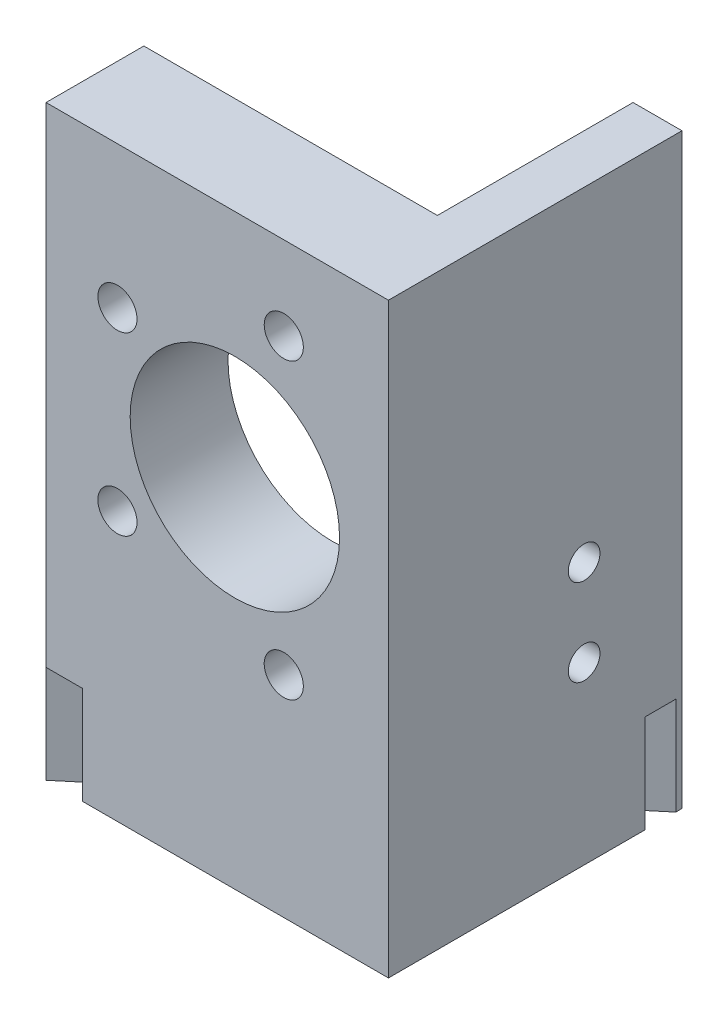
ISO-10303-21;
HEADER;
FILE_DESCRIPTION(('STEP AP214'),'2;1');
FILE_NAME('part.step','',(''),(''),'','','');
FILE_SCHEMA(('AUTOMOTIVE_DESIGN { 1 0 10303 214 1 1 1 1 }'));
ENDSEC;
DATA;
#1=APPLICATION_CONTEXT('core data for automotive mechanical design processes');
#2=APPLICATION_PROTOCOL_DEFINITION('international standard','automotive_design',2000,#1);
#3=PRODUCT_CONTEXT('',#1,'mechanical');
#4=PRODUCT('Part','Part','',(#3));
#5=PRODUCT_RELATED_PRODUCT_CATEGORY('part','',(#4));
#6=PRODUCT_DEFINITION_FORMATION('','',#4);
#7=PRODUCT_DEFINITION_CONTEXT('part definition',#1,'design');
#8=PRODUCT_DEFINITION('design','',#6,#7);
#9=PRODUCT_DEFINITION_SHAPE('','',#8);
#10=(LENGTH_UNIT() NAMED_UNIT(*) SI_UNIT(.MILLI.,.METRE.));
#11=(NAMED_UNIT(*) PLANE_ANGLE_UNIT() SI_UNIT($,.RADIAN.));
#12=(NAMED_UNIT(*) SI_UNIT($,.STERADIAN.) SOLID_ANGLE_UNIT());
#13=UNCERTAINTY_MEASURE_WITH_UNIT(LENGTH_MEASURE(1.E-05),#10,'distance_accuracy_value','');
#14=(GEOMETRIC_REPRESENTATION_CONTEXT(3) GLOBAL_UNCERTAINTY_ASSIGNED_CONTEXT((#13)) GLOBAL_UNIT_ASSIGNED_CONTEXT((#10,
#11,#12)) REPRESENTATION_CONTEXT('',''));
#15=CARTESIAN_POINT('',(0.,0.,0.));
#16=DIRECTION('',(0.,0.,1.));
#17=DIRECTION('',(1.,0.,0.));
#18=AXIS2_PLACEMENT_3D('',#15,#16,#17);
#19=CARTESIAN_POINT('',(0.,0.,0.));
#20=DIRECTION('',(0.,1.,0.));
#21=DIRECTION('',(0.,0.,1.));
#22=AXIS2_PLACEMENT_3D('',#19,#20,#21);
#23=PLANE('',#22);
#24=DIRECTION('',(1.,0.,0.));
#25=VECTOR('',#24,1.);
#26=CARTESIAN_POINT('',(-44.45,0.,0.));
#27=LINE('',#26,#25);
#28=CARTESIAN_POINT('',(-39.7081537757294,0.,0.));
#29=VERTEX_POINT('',#28);
#30=CARTESIAN_POINT('',(0.,0.,0.));
#31=VERTEX_POINT('',#30);
#32=EDGE_CURVE('E174',#29,#31,#27,.T.);
#33=ORIENTED_EDGE('',*,*,#32,.F.);
#34=DIRECTION('',(0.766044443118982,0.,-0.642787609686534));
#35=VECTOR('',#34,1.);
#36=CARTESIAN_POINT('',(-16.4064526170276,0.,-19.5524488480696));
#37=LINE('',#36,#35);
#38=CARTESIAN_POINT('',(-24.5728831497828,0.,-12.7));
#39=VERTEX_POINT('',#38);
#40=EDGE_CURVE('E43',#29,#39,#37,.T.);
#41=ORIENTED_EDGE('',*,*,#40,.T.);
#42=DIRECTION('',(-1.,0.,0.));
#43=VECTOR('',#42,1.);
#44=CARTESIAN_POINT('',(-6.35000000000001,0.,-12.7));
#45=LINE('',#44,#43);
#46=CARTESIAN_POINT('',(-6.35000000000001,0.,-12.7));
#47=VERTEX_POINT('',#46);
#48=EDGE_CURVE('E163',#47,#39,#45,.T.);
#49=ORIENTED_EDGE('',*,*,#48,.F.);
#50=DIRECTION('',(0.,0.,1.));
#51=VECTOR('',#50,1.);
#52=CARTESIAN_POINT('',(-6.35,0.,-38.1));
#53=LINE('',#52,#51);
#54=CARTESIAN_POINT('',(-6.35,0.,-27.9908145299692));
#55=VERTEX_POINT('',#54);
#56=EDGE_CURVE('E182',#55,#47,#53,.T.);
#57=ORIENTED_EDGE('',*,*,#56,.F.);
#58=CARTESIAN_POINT('',(0.,0.,-33.3190971879449));
#59=VERTEX_POINT('',#58);
#60=EDGE_CURVE('E203',#55,#59,#37,.T.);
#61=ORIENTED_EDGE('',*,*,#60,.T.);
#62=DIRECTION('',(0.,0.,-1.));
#63=VECTOR('',#62,1.);
#64=CARTESIAN_POINT('',(0.,0.,0.));
#65=LINE('',#64,#63);
#66=EDGE_CURVE('E177',#31,#59,#65,.T.);
#67=ORIENTED_EDGE('',*,*,#66,.F.);
#68=EDGE_LOOP('',(#33,#41,#49,#57,#61,#67));
#69=FACE_BOUND('',#68,.T.);
#70=ADVANCED_FACE('F35',(#69),#23,.F.);
#71=CARTESIAN_POINT('',(0.,0.,-37.2979786058297));
#72=VERTEX_POINT('',#71);
#73=CARTESIAN_POINT('',(0.,0.,-38.1));
#74=VERTEX_POINT('',#73);
#75=EDGE_CURVE('E176',#72,#74,#65,.T.);
#76=ORIENTED_EDGE('',*,*,#75,.F.);
#77=DIRECTION('',(-0.766044443118982,0.,0.642787609686535));
#78=VECTOR('',#77,1.);
#79=CARTESIAN_POINT('',(-18.3656692513522,0.,-21.8873523106963));
#80=LINE('',#79,#78);
#81=CARTESIAN_POINT('',(-6.35,0.,-31.969695947854));
#82=VERTEX_POINT('',#81);
#83=EDGE_CURVE('E147',#72,#82,#80,.T.);
#84=ORIENTED_EDGE('',*,*,#83,.T.);
#85=CARTESIAN_POINT('',(-6.35,0.,-38.1));
#86=VERTEX_POINT('',#85);
#87=EDGE_CURVE('E183',#86,#82,#53,.T.);
#88=ORIENTED_EDGE('',*,*,#87,.F.);
#89=DIRECTION('',(-1.,0.,0.));
#90=VECTOR('',#89,1.);
#91=CARTESIAN_POINT('',(0.,0.,-38.1));
#92=LINE('',#91,#90);
#93=EDGE_CURVE('E180',#74,#86,#92,.T.);
#94=ORIENTED_EDGE('',*,*,#93,.F.);
#95=EDGE_LOOP('',(#76,#84,#88,#94));
#96=FACE_BOUND('',#95,.T.);
#97=ADVANCED_FACE('F212',(#96),#23,.F.);
#98=CARTESIAN_POINT('',(-6.35000000000001,76.2,-12.7));
#99=DIRECTION('',(0.,0.,1.));
#100=DIRECTION('',(1.,0.,0.));
#101=AXIS2_PLACEMENT_3D('',#98,#99,#100);
#102=PLANE('',#101);
#103=ORIENTED_EDGE('',*,*,#48,.T.);
#104=DIRECTION('',(0.,1.,0.));
#105=VECTOR('',#104,1.);
#106=CARTESIAN_POINT('',(-24.5728831497828,76.2,-12.7));
#107=LINE('',#106,#105);
#108=CARTESIAN_POINT('',(-24.5728831497828,12.7,-12.7));
#109=VERTEX_POINT('',#108);
#110=EDGE_CURVE('E248',#39,#109,#107,.T.);
#111=ORIENTED_EDGE('',*,*,#110,.T.);
#112=DIRECTION('',(-1.,0.,0.));
#113=VECTOR('',#112,1.);
#114=CARTESIAN_POINT('',(-6.35000000000001,12.7,-12.7));
#115=LINE('',#114,#113);
#116=CARTESIAN_POINT('',(-29.3147293740534,12.7,-12.7));
#117=VERTEX_POINT('',#116);
#118=EDGE_CURVE('E157',#109,#117,#115,.T.);
#119=ORIENTED_EDGE('',*,*,#118,.T.);
#120=DIRECTION('',(0.,-1.,0.));
#121=VECTOR('',#120,1.);
#122=CARTESIAN_POINT('',(-29.3147293740534,76.2,-12.7));
#123=LINE('',#122,#121);
#124=CARTESIAN_POINT('',(-29.3147293740534,0.,-12.7));
#125=VERTEX_POINT('',#124);
#126=EDGE_CURVE('E139',#117,#125,#123,.T.);
#127=ORIENTED_EDGE('',*,*,#126,.T.);
#128=CARTESIAN_POINT('',(-44.45,0.,-12.7));
#129=VERTEX_POINT('',#128);
#130=EDGE_CURVE('E155',#125,#129,#45,.T.);
#131=ORIENTED_EDGE('',*,*,#130,.T.);
#132=DIRECTION('',(0.,-1.,0.));
#133=VECTOR('',#132,1.);
#134=CARTESIAN_POINT('',(-44.45,76.2,-12.7));
#135=LINE('',#134,#133);
#136=CARTESIAN_POINT('',(-44.45,76.2,-12.7));
#137=VERTEX_POINT('',#136);
#138=EDGE_CURVE('E148',#137,#129,#135,.T.);
#139=ORIENTED_EDGE('',*,*,#138,.F.);
#140=DIRECTION('',(-1.,0.,0.));
#141=VECTOR('',#140,1.);
#142=CARTESIAN_POINT('',(-6.35000000000001,76.2,-12.7));
#143=LINE('',#142,#141);
#144=CARTESIAN_POINT('',(-6.35000000000001,76.2,-12.7));
#145=VERTEX_POINT('',#144);
#146=EDGE_CURVE('E186',#145,#137,#143,.T.);
#147=ORIENTED_EDGE('',*,*,#146,.F.);
#148=DIRECTION('',(0.,-1.,0.));
#149=VECTOR('',#148,1.);
#150=CARTESIAN_POINT('',(-6.35000000000001,76.2,-12.7));
#151=LINE('',#150,#149);
#152=CARTESIAN_POINT('',(-6.35000000000001,46.3296,-12.7));
#153=VERTEX_POINT('',#152);
#154=EDGE_CURVE('E187',#145,#153,#151,.T.);
#155=ORIENTED_EDGE('',*,*,#154,.T.);
#156=CARTESIAN_POINT('',(-19.939,46.3296,-12.7));
#157=DIRECTION('',(0.,0.,-1.));
#158=DIRECTION('',(-1.,0.,0.));
#159=AXIS2_PLACEMENT_3D('',#156,#157,#158);
#160=CIRCLE('',#159,13.589);
#161=EDGE_CURVE('E56',#153,#153,#160,.T.);
#162=ORIENTED_EDGE('',*,*,#161,.F.);
#163=EDGE_CURVE('E191',#153,#47,#151,.T.);
#164=ORIENTED_EDGE('',*,*,#163,.T.);
#165=EDGE_LOOP('',(#103,#111,#119,#127,#131,#139,#147,#155,#162,#164));
#166=FACE_BOUND('',#165,.T.);
#167=CARTESIAN_POINT('',(-35.179,34.8996,-12.7));
#168=DIRECTION('',(0.,0.,-1.));
#169=DIRECTION('',(1.,0.,0.));
#170=AXIS2_PLACEMENT_3D('',#167,#168,#169);
#171=CIRCLE('',#170,2.54);
#172=CARTESIAN_POINT('',(-32.639,34.8996,-12.7));
#173=VERTEX_POINT('',#172);
#174=EDGE_CURVE('E255',#173,#173,#171,.T.);
#175=ORIENTED_EDGE('',*,*,#174,.F.);
#176=EDGE_LOOP('',(#175));
#177=FACE_BOUND('',#176,.T.);
#178=CARTESIAN_POINT('',(-13.589,27.2796,-12.7));
#179=DIRECTION('',(0.,0.,-1.));
#180=DIRECTION('',(1.,0.,0.));
#181=AXIS2_PLACEMENT_3D('',#178,#179,#180);
#182=CIRCLE('',#181,2.53999999999999);
#183=CARTESIAN_POINT('',(-11.049,27.2796,-12.7));
#184=VERTEX_POINT('',#183);
#185=EDGE_CURVE('E259',#184,#184,#182,.T.);
#186=ORIENTED_EDGE('',*,*,#185,.F.);
#187=EDGE_LOOP('',(#186));
#188=FACE_BOUND('',#187,.T.);
#189=CARTESIAN_POINT('',(-13.589,65.3796,-12.7));
#190=DIRECTION('',(0.,0.,-1.));
#191=DIRECTION('',(-1.,0.,0.));
#192=AXIS2_PLACEMENT_3D('',#189,#190,#191);
#193=CIRCLE('',#192,2.54);
#194=CARTESIAN_POINT('',(-16.129,65.3796,-12.7));
#195=VERTEX_POINT('',#194);
#196=EDGE_CURVE('E265',#195,#195,#193,.T.);
#197=ORIENTED_EDGE('',*,*,#196,.F.);
#198=EDGE_LOOP('',(#197));
#199=FACE_BOUND('',#198,.T.);
#200=CARTESIAN_POINT('',(-35.179,57.7596,-12.7));
#201=DIRECTION('',(0.,0.,-1.));
#202=DIRECTION('',(-1.,0.,0.));
#203=AXIS2_PLACEMENT_3D('',#200,#201,#202);
#204=CIRCLE('',#203,2.54);
#205=CARTESIAN_POINT('',(-37.719,57.7596,-12.7));
#206=VERTEX_POINT('',#205);
#207=EDGE_CURVE('E271',#206,#206,#204,.T.);
#208=ORIENTED_EDGE('',*,*,#207,.F.);
#209=EDGE_LOOP('',(#208));
#210=FACE_BOUND('',#209,.T.);
#211=ADVANCED_FACE('F37',(#166,#177,#188,#199,#210),#102,.F.);
#212=CARTESIAN_POINT('',(-44.45,76.2,-12.7));
#213=DIRECTION('',(1.,0.,0.));
#214=DIRECTION('',(0.,0.,-1.));
#215=AXIS2_PLACEMENT_3D('',#212,#213,#214);
#216=PLANE('',#215);
#217=DIRECTION('',(0.,0.,1.));
#218=VECTOR('',#217,1.);
#219=CARTESIAN_POINT('',(-44.45,0.,-12.7));
#220=LINE('',#219,#218);
#221=CARTESIAN_POINT('',(-44.45,0.,0.));
#222=VERTEX_POINT('',#221);
#223=EDGE_CURVE('E161',#129,#222,#220,.T.);
#224=ORIENTED_EDGE('',*,*,#223,.T.);
#225=DIRECTION('',(0.,1.,0.));
#226=VECTOR('',#225,1.);
#227=CARTESIAN_POINT('',(-44.45,76.2,0.));
#228=LINE('',#227,#226);
#229=CARTESIAN_POINT('',(-44.45,12.7,0.));
#230=VERTEX_POINT('',#229);
#231=EDGE_CURVE('E142',#222,#230,#228,.T.);
#232=ORIENTED_EDGE('',*,*,#231,.T.);
#233=DIRECTION('',(0.,-1.,0.));
#234=VECTOR('',#233,1.);
#235=CARTESIAN_POINT('',(-44.45,76.2,0.));
#236=LINE('',#235,#234);
#237=CARTESIAN_POINT('',(-44.45,76.2,0.));
#238=VERTEX_POINT('',#237);
#239=EDGE_CURVE('E200',#238,#230,#236,.T.);
#240=ORIENTED_EDGE('',*,*,#239,.F.);
#241=DIRECTION('',(0.,0.,1.));
#242=VECTOR('',#241,1.);
#243=CARTESIAN_POINT('',(-44.45,76.2,-12.7));
#244=LINE('',#243,#242);
#245=EDGE_CURVE('E293',#137,#238,#244,.T.);
#246=ORIENTED_EDGE('',*,*,#245,.F.);
#247=ORIENTED_EDGE('',*,*,#138,.T.);
#248=EDGE_LOOP('',(#224,#232,#240,#246,#247));
#249=FACE_BOUND('',#248,.T.);
#250=ADVANCED_FACE('F318',(#249),#216,.F.);
#251=CARTESIAN_POINT('',(-44.45,76.2,0.));
#252=DIRECTION('',(0.,0.,-1.));
#253=DIRECTION('',(-1.,0.,0.));
#254=AXIS2_PLACEMENT_3D('',#251,#252,#253);
#255=PLANE('',#254);
#256=CARTESIAN_POINT('',(-35.179,34.8996,0.));
#257=DIRECTION('',(0.,0.,-1.));
#258=DIRECTION('',(1.,0.,0.));
#259=AXIS2_PLACEMENT_3D('',#256,#257,#258);
#260=CIRCLE('',#259,2.54);
#261=CARTESIAN_POINT('',(-32.639,34.8996,0.));
#262=VERTEX_POINT('',#261);
#263=EDGE_CURVE('E256',#262,#262,#260,.T.);
#264=ORIENTED_EDGE('',*,*,#263,.T.);
#265=EDGE_LOOP('',(#264));
#266=FACE_BOUND('',#265,.T.);
#267=CARTESIAN_POINT('',(-13.589,27.2796,0.));
#268=DIRECTION('',(0.,0.,-1.));
#269=DIRECTION('',(1.,0.,0.));
#270=AXIS2_PLACEMENT_3D('',#267,#268,#269);
#271=CIRCLE('',#270,2.53999999999999);
#272=CARTESIAN_POINT('',(-11.049,27.2796,0.));
#273=VERTEX_POINT('',#272);
#274=EDGE_CURVE('E262',#273,#273,#271,.T.);
#275=ORIENTED_EDGE('',*,*,#274,.T.);
#276=EDGE_LOOP('',(#275));
#277=FACE_BOUND('',#276,.T.);
#278=CARTESIAN_POINT('',(-13.589,65.3796,0.));
#279=DIRECTION('',(0.,0.,-1.));
#280=DIRECTION('',(-1.,0.,0.));
#281=AXIS2_PLACEMENT_3D('',#278,#279,#280);
#282=CIRCLE('',#281,2.54);
#283=CARTESIAN_POINT('',(-16.129,65.3796,0.));
#284=VERTEX_POINT('',#283);
#285=EDGE_CURVE('E268',#284,#284,#282,.T.);
#286=ORIENTED_EDGE('',*,*,#285,.T.);
#287=EDGE_LOOP('',(#286));
#288=FACE_BOUND('',#287,.T.);
#289=CARTESIAN_POINT('',(-35.179,57.7596,0.));
#290=DIRECTION('',(0.,0.,-1.));
#291=DIRECTION('',(-1.,0.,0.));
#292=AXIS2_PLACEMENT_3D('',#289,#290,#291);
#293=CIRCLE('',#292,2.54);
#294=CARTESIAN_POINT('',(-37.719,57.7596,0.));
#295=VERTEX_POINT('',#294);
#296=EDGE_CURVE('E274',#295,#295,#293,.T.);
#297=ORIENTED_EDGE('',*,*,#296,.T.);
#298=EDGE_LOOP('',(#297));
#299=FACE_BOUND('',#298,.T.);
#300=CARTESIAN_POINT('',(-19.939,46.3296,0.));
#301=DIRECTION('',(0.,0.,-1.));
#302=DIRECTION('',(-1.,0.,0.));
#303=AXIS2_PLACEMENT_3D('',#300,#301,#302);
#304=CIRCLE('',#303,13.589);
#305=CARTESIAN_POINT('',(-33.528,46.3296,0.));
#306=VERTEX_POINT('',#305);
#307=EDGE_CURVE('E279',#306,#306,#304,.T.);
#308=ORIENTED_EDGE('',*,*,#307,.T.);
#309=EDGE_LOOP('',(#308));
#310=FACE_BOUND('',#309,.T.);
#311=DIRECTION('',(1.,0.,0.));
#312=VECTOR('',#311,1.);
#313=CARTESIAN_POINT('',(-44.45,12.7,0.));
#314=LINE('',#313,#312);
#315=CARTESIAN_POINT('',(-39.7081537757294,12.7,0.));
#316=VERTEX_POINT('',#315);
#317=EDGE_CURVE('E251',#230,#316,#314,.T.);
#318=ORIENTED_EDGE('',*,*,#317,.T.);
#319=DIRECTION('',(0.,-1.,0.));
#320=VECTOR('',#319,1.);
#321=CARTESIAN_POINT('',(-39.7081537757294,76.2,0.));
#322=LINE('',#321,#320);
#323=EDGE_CURVE('E245',#316,#29,#322,.T.);
#324=ORIENTED_EDGE('',*,*,#323,.T.);
#325=ORIENTED_EDGE('',*,*,#32,.T.);
#326=DIRECTION('',(0.,-1.,0.));
#327=VECTOR('',#326,1.);
#328=CARTESIAN_POINT('',(0.,76.2,0.));
#329=LINE('',#328,#327);
#330=CARTESIAN_POINT('',(0.,76.2,0.));
#331=VERTEX_POINT('',#330);
#332=EDGE_CURVE('E197',#331,#31,#329,.T.);
#333=ORIENTED_EDGE('',*,*,#332,.F.);
#334=DIRECTION('',(1.,0.,0.));
#335=VECTOR('',#334,1.);
#336=CARTESIAN_POINT('',(-44.45,76.2,0.));
#337=LINE('',#336,#335);
#338=EDGE_CURVE('E295',#238,#331,#337,.T.);
#339=ORIENTED_EDGE('',*,*,#338,.F.);
#340=ORIENTED_EDGE('',*,*,#239,.T.);
#341=EDGE_LOOP('',(#318,#324,#325,#333,#339,#340));
#342=FACE_BOUND('',#341,.T.);
#343=ADVANCED_FACE('F307',(#266,#277,#288,#299,#310,#342),#255,.F.);
#344=CARTESIAN_POINT('',(0.,76.2,0.));
#345=DIRECTION('',(-1.,0.,0.));
#346=DIRECTION('',(0.,0.,1.));
#347=AXIS2_PLACEMENT_3D('',#344,#345,#346);
#348=PLANE('',#347);
#349=ORIENTED_EDGE('',*,*,#66,.T.);
#350=DIRECTION('',(0.,1.,0.));
#351=VECTOR('',#350,1.);
#352=CARTESIAN_POINT('',(0.,76.2,-33.3190971879449));
#353=LINE('',#352,#351);
#354=CARTESIAN_POINT('',(0.,12.7,-33.3190971879449));
#355=VERTEX_POINT('',#354);
#356=EDGE_CURVE('E243',#59,#355,#353,.T.);
#357=ORIENTED_EDGE('',*,*,#356,.T.);
#358=DIRECTION('',(0.,0.,-1.));
#359=VECTOR('',#358,1.);
#360=CARTESIAN_POINT('',(0.,12.7,0.));
#361=LINE('',#360,#359);
#362=CARTESIAN_POINT('',(0.,12.7,-37.2979786058297));
#363=VERTEX_POINT('',#362);
#364=EDGE_CURVE('E233',#355,#363,#361,.T.);
#365=ORIENTED_EDGE('',*,*,#364,.T.);
#366=DIRECTION('',(0.,-1.,0.));
#367=VECTOR('',#366,1.);
#368=CARTESIAN_POINT('',(0.,76.2,-37.2979786058297));
#369=LINE('',#368,#367);
#370=EDGE_CURVE('E231',#363,#72,#369,.T.);
#371=ORIENTED_EDGE('',*,*,#370,.T.);
#372=ORIENTED_EDGE('',*,*,#75,.T.);
#373=DIRECTION('',(0.,-1.,0.));
#374=VECTOR('',#373,1.);
#375=CARTESIAN_POINT('',(0.,76.2,-38.1));
#376=LINE('',#375,#374);
#377=CARTESIAN_POINT('',(0.,76.2,-38.1));
#378=VERTEX_POINT('',#377);
#379=EDGE_CURVE('E194',#378,#74,#376,.T.);
#380=ORIENTED_EDGE('',*,*,#379,.F.);
#381=DIRECTION('',(0.,0.,-1.));
#382=VECTOR('',#381,1.);
#383=CARTESIAN_POINT('',(0.,76.2,0.));
#384=LINE('',#383,#382);
#385=EDGE_CURVE('E229',#331,#378,#384,.T.);
#386=ORIENTED_EDGE('',*,*,#385,.F.);
#387=ORIENTED_EDGE('',*,*,#332,.T.);
#388=EDGE_LOOP('',(#349,#357,#365,#371,#372,#380,#386,#387));
#389=FACE_BOUND('',#388,.T.);
#390=CARTESIAN_POINT('',(0.,34.036,-25.4));
#391=DIRECTION('',(-1.,0.,0.));
#392=DIRECTION('',(0.,0.,1.));
#393=AXIS2_PLACEMENT_3D('',#390,#391,#392);
#394=CIRCLE('',#393,2.0574);
#395=CARTESIAN_POINT('',(0.,34.036,-23.3426));
#396=VERTEX_POINT('',#395);
#397=EDGE_CURVE('E284',#396,#396,#394,.T.);
#398=ORIENTED_EDGE('',*,*,#397,.T.);
#399=EDGE_LOOP('',(#398));
#400=FACE_BOUND('',#399,.T.);
#401=CARTESIAN_POINT('',(0.,22.7838,-25.4));
#402=DIRECTION('',(-1.,0.,0.));
#403=DIRECTION('',(0.,0.,1.));
#404=AXIS2_PLACEMENT_3D('',#401,#402,#403);
#405=CIRCLE('',#404,2.0574);
#406=CARTESIAN_POINT('',(0.,22.7838,-23.3426));
#407=VERTEX_POINT('',#406);
#408=EDGE_CURVE('E164',#407,#407,#405,.T.);
#409=ORIENTED_EDGE('',*,*,#408,.T.);
#410=EDGE_LOOP('',(#409));
#411=FACE_BOUND('',#410,.T.);
#412=ADVANCED_FACE('F227',(#389,#400,#411),#348,.F.);
#413=CARTESIAN_POINT('',(0.,76.2,-38.1));
#414=DIRECTION('',(0.,0.,1.));
#415=DIRECTION('',(1.,0.,0.));
#416=AXIS2_PLACEMENT_3D('',#413,#414,#415);
#417=PLANE('',#416);
#418=ORIENTED_EDGE('',*,*,#93,.T.);
#419=DIRECTION('',(0.,-1.,0.));
#420=VECTOR('',#419,1.);
#421=CARTESIAN_POINT('',(-6.35,76.2,-38.1));
#422=LINE('',#421,#420);
#423=CARTESIAN_POINT('',(-6.35,76.2,-38.1));
#424=VERTEX_POINT('',#423);
#425=EDGE_CURVE('E190',#424,#86,#422,.T.);
#426=ORIENTED_EDGE('',*,*,#425,.F.);
#427=DIRECTION('',(-1.,0.,0.));
#428=VECTOR('',#427,1.);
#429=CARTESIAN_POINT('',(0.,76.2,-38.1));
#430=LINE('',#429,#428);
#431=EDGE_CURVE('E223',#378,#424,#430,.T.);
#432=ORIENTED_EDGE('',*,*,#431,.F.);
#433=ORIENTED_EDGE('',*,*,#379,.T.);
#434=EDGE_LOOP('',(#418,#426,#432,#433));
#435=FACE_BOUND('',#434,.T.);
#436=ADVANCED_FACE('F222',(#435),#417,.F.);
#437=CARTESIAN_POINT('',(-6.35,76.2,-38.1));
#438=DIRECTION('',(1.,0.,0.));
#439=DIRECTION('',(0.,0.,-1.));
#440=AXIS2_PLACEMENT_3D('',#437,#438,#439);
#441=PLANE('',#440);
#442=CARTESIAN_POINT('',(-6.35000000000002,34.036,-25.4));
#443=DIRECTION('',(-1.,0.,0.));
#444=DIRECTION('',(0.,0.,1.));
#445=AXIS2_PLACEMENT_3D('',#442,#443,#444);
#446=CIRCLE('',#445,2.0574);
#447=CARTESIAN_POINT('',(-6.35000000000002,34.036,-23.3426));
#448=VERTEX_POINT('',#447);
#449=EDGE_CURVE('E282',#448,#448,#446,.T.);
#450=ORIENTED_EDGE('',*,*,#449,.F.);
#451=EDGE_LOOP('',(#450));
#452=FACE_BOUND('',#451,.T.);
#453=CARTESIAN_POINT('',(-6.35000000000002,22.7838,-25.4));
#454=DIRECTION('',(-1.,0.,0.));
#455=DIRECTION('',(0.,0.,1.));
#456=AXIS2_PLACEMENT_3D('',#453,#454,#455);
#457=CIRCLE('',#456,2.0574);
#458=CARTESIAN_POINT('',(-6.35000000000002,22.7838,-23.3426));
#459=VERTEX_POINT('',#458);
#460=EDGE_CURVE('E167',#459,#459,#457,.T.);
#461=ORIENTED_EDGE('',*,*,#460,.F.);
#462=EDGE_LOOP('',(#461));
#463=FACE_BOUND('',#462,.T.);
#464=DIRECTION('',(0.,0.,1.));
#465=VECTOR('',#464,1.);
#466=CARTESIAN_POINT('',(-6.35,12.7,-38.1));
#467=LINE('',#466,#465);
#468=CARTESIAN_POINT('',(-6.35,12.7,-31.969695947854));
#469=VERTEX_POINT('',#468);
#470=CARTESIAN_POINT('',(-6.35,12.7,-27.9908145299692));
#471=VERTEX_POINT('',#470);
#472=EDGE_CURVE('E11',#469,#471,#467,.T.);
#473=ORIENTED_EDGE('',*,*,#472,.T.);
#474=DIRECTION('',(0.,-1.,0.));
#475=VECTOR('',#474,1.);
#476=CARTESIAN_POINT('',(-6.35,76.2,-27.9908145299692));
#477=LINE('',#476,#475);
#478=EDGE_CURVE('E158',#471,#55,#477,.T.);
#479=ORIENTED_EDGE('',*,*,#478,.T.);
#480=ORIENTED_EDGE('',*,*,#56,.T.);
#481=ORIENTED_EDGE('',*,*,#163,.F.);
#482=ORIENTED_EDGE('',*,*,#154,.F.);
#483=DIRECTION('',(0.,0.,1.));
#484=VECTOR('',#483,1.);
#485=CARTESIAN_POINT('',(-6.35,76.2,-38.1));
#486=LINE('',#485,#484);
#487=EDGE_CURVE('E171',#424,#145,#486,.T.);
#488=ORIENTED_EDGE('',*,*,#487,.F.);
#489=ORIENTED_EDGE('',*,*,#425,.T.);
#490=ORIENTED_EDGE('',*,*,#87,.T.);
#491=DIRECTION('',(0.,1.,0.));
#492=VECTOR('',#491,1.);
#493=CARTESIAN_POINT('',(-6.35,76.2,-31.969695947854));
#494=LINE('',#493,#492);
#495=EDGE_CURVE('E50',#82,#469,#494,.T.);
#496=ORIENTED_EDGE('',*,*,#495,.T.);
#497=EDGE_LOOP('',(#473,#479,#480,#481,#482,#488,#489,#490,#496));
#498=FACE_BOUND('',#497,.T.);
#499=ADVANCED_FACE('F216',(#452,#463,#498),#441,.F.);
#500=CARTESIAN_POINT('',(0.,76.2,0.));
#501=DIRECTION('',(0.,1.,0.));
#502=DIRECTION('',(0.,0.,1.));
#503=AXIS2_PLACEMENT_3D('',#500,#501,#502);
#504=PLANE('',#503);
#505=ORIENTED_EDGE('',*,*,#146,.T.);
#506=ORIENTED_EDGE('',*,*,#245,.T.);
#507=ORIENTED_EDGE('',*,*,#338,.T.);
#508=ORIENTED_EDGE('',*,*,#385,.T.);
#509=ORIENTED_EDGE('',*,*,#431,.T.);
#510=ORIENTED_EDGE('',*,*,#487,.T.);
#511=EDGE_LOOP('',(#505,#506,#507,#508,#509,#510));
#512=FACE_BOUND('',#511,.T.);
#513=ADVANCED_FACE('F320',(#512),#504,.T.);
#514=ORIENTED_EDGE('',*,*,#130,.F.);
#515=EDGE_CURVE('E135',#125,#222,#80,.T.);
#516=ORIENTED_EDGE('',*,*,#515,.T.);
#517=ORIENTED_EDGE('',*,*,#223,.F.);
#518=EDGE_LOOP('',(#514,#516,#517));
#519=FACE_BOUND('',#518,.T.);
#520=ADVANCED_FACE('F160',(#519),#23,.F.);
#521=CARTESIAN_POINT('',(0.,22.7838,-25.4));
#522=DIRECTION('',(-1.,0.,0.));
#523=DIRECTION('',(0.,0.,1.));
#524=AXIS2_PLACEMENT_3D('',#521,#522,#523);
#525=CYLINDRICAL_SURFACE('',#524,2.0574);
#526=ORIENTED_EDGE('',*,*,#408,.F.);
#527=EDGE_LOOP('',(#526));
#528=FACE_BOUND('',#527,.T.);
#529=ORIENTED_EDGE('',*,*,#460,.T.);
#530=EDGE_LOOP('',(#529));
#531=FACE_BOUND('',#530,.T.);
#532=ADVANCED_FACE('F345',(#528,#531),#525,.F.);
#533=CARTESIAN_POINT('',(0.,34.036,-25.4));
#534=DIRECTION('',(-1.,0.,0.));
#535=DIRECTION('',(0.,0.,1.));
#536=AXIS2_PLACEMENT_3D('',#533,#534,#535);
#537=CYLINDRICAL_SURFACE('',#536,2.0574);
#538=ORIENTED_EDGE('',*,*,#397,.F.);
#539=EDGE_LOOP('',(#538));
#540=FACE_BOUND('',#539,.T.);
#541=ORIENTED_EDGE('',*,*,#449,.T.);
#542=EDGE_LOOP('',(#541));
#543=FACE_BOUND('',#542,.T.);
#544=ADVANCED_FACE('F350',(#540,#543),#537,.F.);
#545=CARTESIAN_POINT('',(-19.939,46.3296,0.));
#546=DIRECTION('',(0.,0.,-1.));
#547=DIRECTION('',(-1.,0.,0.));
#548=AXIS2_PLACEMENT_3D('',#545,#546,#547);
#549=CYLINDRICAL_SURFACE('',#548,13.589);
#550=ORIENTED_EDGE('',*,*,#307,.F.);
#551=EDGE_LOOP('',(#550));
#552=FACE_BOUND('',#551,.T.);
#553=ORIENTED_EDGE('',*,*,#161,.T.);
#554=EDGE_LOOP('',(#553));
#555=FACE_BOUND('',#554,.T.);
#556=ADVANCED_FACE('F360',(#552,#555),#549,.F.);
#557=CARTESIAN_POINT('',(-35.179,57.7596,0.));
#558=DIRECTION('',(0.,0.,-1.));
#559=DIRECTION('',(-1.,0.,0.));
#560=AXIS2_PLACEMENT_3D('',#557,#558,#559);
#561=CYLINDRICAL_SURFACE('',#560,2.54);
#562=ORIENTED_EDGE('',*,*,#296,.F.);
#563=EDGE_LOOP('',(#562));
#564=FACE_BOUND('',#563,.T.);
#565=ORIENTED_EDGE('',*,*,#207,.T.);
#566=EDGE_LOOP('',(#565));
#567=FACE_BOUND('',#566,.T.);
#568=ADVANCED_FACE('F364',(#564,#567),#561,.F.);
#569=CARTESIAN_POINT('',(-13.589,65.3796,0.));
#570=DIRECTION('',(0.,0.,-1.));
#571=DIRECTION('',(-1.,0.,0.));
#572=AXIS2_PLACEMENT_3D('',#569,#570,#571);
#573=CYLINDRICAL_SURFACE('',#572,2.54);
#574=ORIENTED_EDGE('',*,*,#285,.F.);
#575=EDGE_LOOP('',(#574));
#576=FACE_BOUND('',#575,.T.);
#577=ORIENTED_EDGE('',*,*,#196,.T.);
#578=EDGE_LOOP('',(#577));
#579=FACE_BOUND('',#578,.T.);
#580=ADVANCED_FACE('F368',(#576,#579),#573,.F.);
#581=CARTESIAN_POINT('',(-13.589,27.2796,0.));
#582=DIRECTION('',(0.,0.,-1.));
#583=DIRECTION('',(-1.,0.,0.));
#584=AXIS2_PLACEMENT_3D('',#581,#582,#583);
#585=CYLINDRICAL_SURFACE('',#584,2.53999999999999);
#586=ORIENTED_EDGE('',*,*,#274,.F.);
#587=EDGE_LOOP('',(#586));
#588=FACE_BOUND('',#587,.T.);
#589=ORIENTED_EDGE('',*,*,#185,.T.);
#590=EDGE_LOOP('',(#589));
#591=FACE_BOUND('',#590,.T.);
#592=ADVANCED_FACE('F372',(#588,#591),#585,.F.);
#593=CARTESIAN_POINT('',(-35.179,34.8996,0.));
#594=DIRECTION('',(0.,0.,-1.));
#595=DIRECTION('',(-1.,0.,0.));
#596=AXIS2_PLACEMENT_3D('',#593,#594,#595);
#597=CYLINDRICAL_SURFACE('',#596,2.54);
#598=ORIENTED_EDGE('',*,*,#263,.F.);
#599=EDGE_LOOP('',(#598));
#600=FACE_BOUND('',#599,.T.);
#601=ORIENTED_EDGE('',*,*,#174,.T.);
#602=EDGE_LOOP('',(#601));
#603=FACE_BOUND('',#602,.T.);
#604=ADVANCED_FACE('F336',(#600,#603),#597,.F.);
#605=CARTESIAN_POINT('',(8.52226170082824,12.7,-44.4490052557908));
#606=DIRECTION('',(-0.642787609686535,0.,-0.766044443118982));
#607=DIRECTION('',(-0.766044443118982,0.,0.642787609686535));
#608=AXIS2_PLACEMENT_3D('',#605,#606,#607);
#609=PLANE('',#608);
#610=DIRECTION('',(0.766044443118982,0.,-0.642787609686535));
#611=VECTOR('',#610,1.);
#612=CARTESIAN_POINT('',(8.52226170082824,12.7,-44.4490052557908));
#613=LINE('',#612,#611);
#614=EDGE_CURVE('E313',#230,#117,#613,.T.);
#615=ORIENTED_EDGE('',*,*,#614,.F.);
#616=ORIENTED_EDGE('',*,*,#231,.F.);
#617=ORIENTED_EDGE('',*,*,#515,.F.);
#618=ORIENTED_EDGE('',*,*,#126,.F.);
#619=EDGE_LOOP('',(#615,#616,#617,#618));
#620=FACE_BOUND('',#619,.T.);
#621=ADVANCED_FACE('F138',(#620),#609,.F.);
#622=CARTESIAN_POINT('',(-47.8911082305136,12.7,6.86631406494981));
#623=DIRECTION('',(0.642787609686534,0.,0.766044443118982));
#624=DIRECTION('',(0.766044443118982,0.,-0.642787609686534));
#625=AXIS2_PLACEMENT_3D('',#622,#623,#624);
#626=PLANE('',#625);
#627=ORIENTED_EDGE('',*,*,#40,.F.);
#628=ORIENTED_EDGE('',*,*,#323,.F.);
#629=DIRECTION('',(-0.766044443118982,0.,0.642787609686534));
#630=VECTOR('',#629,1.);
#631=CARTESIAN_POINT('',(-47.8911082305136,12.7,6.86631406494981));
#632=LINE('',#631,#630);
#633=EDGE_CURVE('E314',#109,#316,#632,.T.);
#634=ORIENTED_EDGE('',*,*,#633,.F.);
#635=ORIENTED_EDGE('',*,*,#110,.F.);
#636=EDGE_LOOP('',(#627,#628,#634,#635));
#637=FACE_BOUND('',#636,.T.);
#638=ADVANCED_FACE('F303',(#637),#626,.F.);
#639=CARTESIAN_POINT('',(0.,12.7,0.));
#640=DIRECTION('',(0.,1.,0.));
#641=DIRECTION('',(0.,0.,1.));
#642=AXIS2_PLACEMENT_3D('',#639,#640,#641);
#643=PLANE('',#642);
#644=ORIENTED_EDGE('',*,*,#633,.T.);
#645=ORIENTED_EDGE('',*,*,#317,.F.);
#646=ORIENTED_EDGE('',*,*,#614,.T.);
#647=ORIENTED_EDGE('',*,*,#118,.F.);
#648=EDGE_LOOP('',(#644,#645,#646,#647));
#649=FACE_BOUND('',#648,.T.);
#650=ADVANCED_FACE('F312',(#649),#643,.F.);
#651=EDGE_CURVE('E237',#355,#471,#632,.T.);
#652=ORIENTED_EDGE('',*,*,#651,.T.);
#653=ORIENTED_EDGE('',*,*,#472,.F.);
#654=EDGE_CURVE('E315',#469,#363,#613,.T.);
#655=ORIENTED_EDGE('',*,*,#654,.T.);
#656=ORIENTED_EDGE('',*,*,#364,.F.);
#657=EDGE_LOOP('',(#652,#653,#655,#656));
#658=FACE_BOUND('',#657,.T.);
#659=ADVANCED_FACE('F326',(#658),#643,.F.);
#660=ORIENTED_EDGE('',*,*,#60,.F.);
#661=ORIENTED_EDGE('',*,*,#478,.F.);
#662=ORIENTED_EDGE('',*,*,#651,.F.);
#663=ORIENTED_EDGE('',*,*,#356,.F.);
#664=EDGE_LOOP('',(#660,#661,#662,#663));
#665=FACE_BOUND('',#664,.T.);
#666=ADVANCED_FACE('F323',(#665),#626,.F.);
#667=ORIENTED_EDGE('',*,*,#654,.F.);
#668=ORIENTED_EDGE('',*,*,#495,.F.);
#669=ORIENTED_EDGE('',*,*,#83,.F.);
#670=ORIENTED_EDGE('',*,*,#370,.F.);
#671=EDGE_LOOP('',(#667,#668,#669,#670));
#672=FACE_BOUND('',#671,.T.);
#673=ADVANCED_FACE('F327',(#672),#609,.F.);
#674=CLOSED_SHELL('',(#70,#97,#211,#250,#343,#412,#436,#499,#513,#520,#532,#544,#556,#568,#580,
#592,#604,#621,#638,#650,#659,#666,#673));
#675=MANIFOLD_SOLID_BREP('B2',#674);
#676=ADVANCED_BREP_SHAPE_REPRESENTATION('',(#18,#675),#14);
#677=SHAPE_DEFINITION_REPRESENTATION(#9,#676);
ENDSEC;
END-ISO-10303-21;
